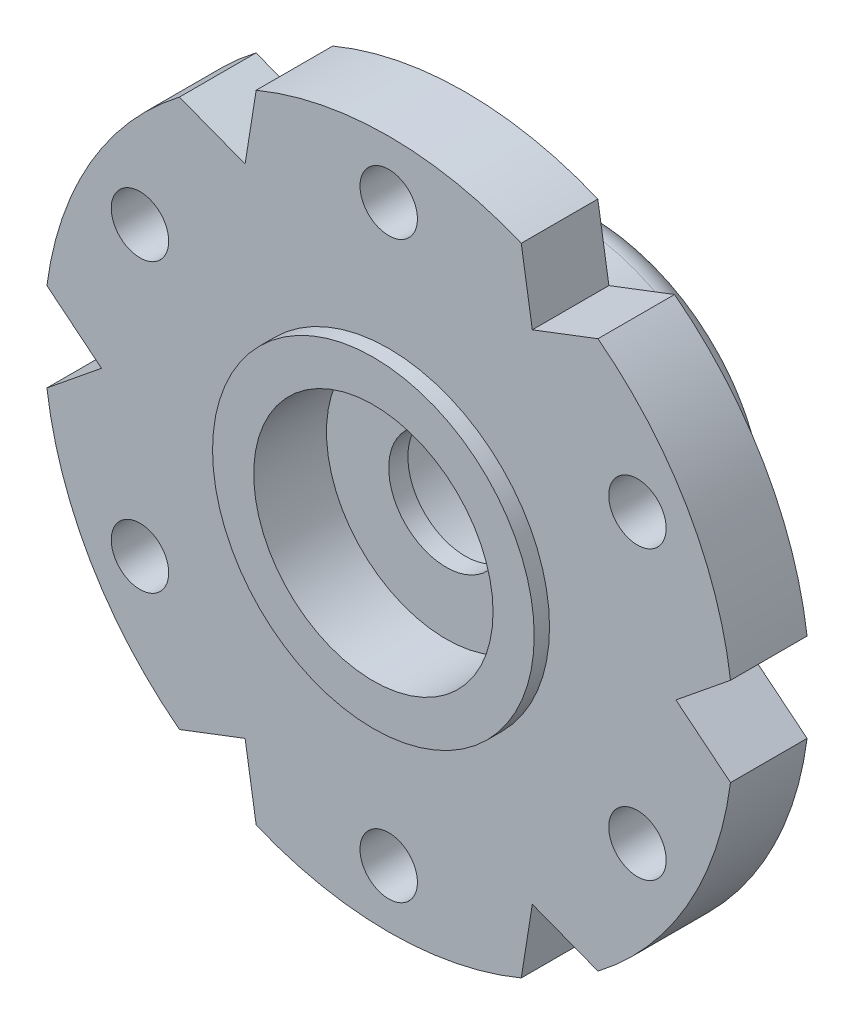
ISO-10303-21;
HEADER;
FILE_DESCRIPTION(('STEP AP214'),'2;1');
FILE_NAME('part.step','',(''),(''),'','','');
FILE_SCHEMA(('AUTOMOTIVE_DESIGN { 1 0 10303 214 1 1 1 1 }'));
ENDSEC;
DATA;
#1=APPLICATION_CONTEXT('core data for automotive mechanical design processes');
#2=APPLICATION_PROTOCOL_DEFINITION('international standard','automotive_design',2000,#1);
#3=PRODUCT_CONTEXT('',#1,'mechanical');
#4=PRODUCT('Part','Part','',(#3));
#5=PRODUCT_RELATED_PRODUCT_CATEGORY('part','',(#4));
#6=PRODUCT_DEFINITION_FORMATION('','',#4);
#7=PRODUCT_DEFINITION_CONTEXT('part definition',#1,'design');
#8=PRODUCT_DEFINITION('design','',#6,#7);
#9=PRODUCT_DEFINITION_SHAPE('','',#8);
#10=(LENGTH_UNIT() NAMED_UNIT(*) SI_UNIT(.MILLI.,.METRE.));
#11=(NAMED_UNIT(*) PLANE_ANGLE_UNIT() SI_UNIT($,.RADIAN.));
#12=(NAMED_UNIT(*) SI_UNIT($,.STERADIAN.) SOLID_ANGLE_UNIT());
#13=UNCERTAINTY_MEASURE_WITH_UNIT(LENGTH_MEASURE(1.E-05),#10,'distance_accuracy_value','');
#14=(GEOMETRIC_REPRESENTATION_CONTEXT(3) GLOBAL_UNCERTAINTY_ASSIGNED_CONTEXT((#13)) GLOBAL_UNIT_ASSIGNED_CONTEXT((#10,
#11,#12)) REPRESENTATION_CONTEXT('',''));
#15=CARTESIAN_POINT('',(0.,0.,0.));
#16=DIRECTION('',(0.,0.,1.));
#17=DIRECTION('',(1.,0.,0.));
#18=AXIS2_PLACEMENT_3D('',#15,#16,#17);
#19=CARTESIAN_POINT('',(0.,13.5,2.));
#20=DIRECTION('',(0.,0.,1.));
#21=DIRECTION('',(1.,0.,0.));
#22=AXIS2_PLACEMENT_3D('',#19,#20,#21);
#23=PLANE('',#22);
#24=CARTESIAN_POINT('',(0.,0.,2.));
#25=DIRECTION('',(0.,0.,1.));
#26=DIRECTION('',(1.,0.,0.));
#27=AXIS2_PLACEMENT_3D('',#24,#25,#26);
#28=CIRCLE('',#27,4.2);
#29=CARTESIAN_POINT('',(4.2,0.,2.));
#30=VERTEX_POINT('',#29);
#31=EDGE_CURVE('E383',#30,#30,#28,.T.);
#32=ORIENTED_EDGE('',*,*,#31,.F.);
#33=EDGE_LOOP('',(#32));
#34=FACE_BOUND('',#33,.T.);
#35=CARTESIAN_POINT('',(-6.49519052838329,3.75,2.));
#36=DIRECTION('',(0.,0.,1.));
#37=DIRECTION('',(1.,0.,0.));
#38=AXIS2_PLACEMENT_3D('',#35,#36,#37);
#39=CIRCLE('',#38,0.749999999999999);
#40=CARTESIAN_POINT('',(-5.74519052838329,3.75,2.));
#41=VERTEX_POINT('',#40);
#42=EDGE_CURVE('E377',#41,#41,#39,.T.);
#43=ORIENTED_EDGE('',*,*,#42,.F.);
#44=EDGE_LOOP('',(#43));
#45=FACE_BOUND('',#44,.T.);
#46=CARTESIAN_POINT('',(0.,-7.5,2.));
#47=DIRECTION('',(0.,0.,1.));
#48=DIRECTION('',(1.,0.,0.));
#49=AXIS2_PLACEMENT_3D('',#46,#47,#48);
#50=CIRCLE('',#49,0.75);
#51=CARTESIAN_POINT('',(0.75,-7.5,2.));
#52=VERTEX_POINT('',#51);
#53=EDGE_CURVE('E395',#52,#52,#50,.T.);
#54=ORIENTED_EDGE('',*,*,#53,.F.);
#55=EDGE_LOOP('',(#54));
#56=FACE_BOUND('',#55,.T.);
#57=CARTESIAN_POINT('',(6.49519052838329,3.75,2.));
#58=DIRECTION('',(0.,0.,1.));
#59=DIRECTION('',(1.,0.,0.));
#60=AXIS2_PLACEMENT_3D('',#57,#58,#59);
#61=CIRCLE('',#60,0.749999999999998);
#62=CARTESIAN_POINT('',(7.24519052838329,3.75,2.));
#63=VERTEX_POINT('',#62);
#64=EDGE_CURVE('E407',#63,#63,#61,.T.);
#65=ORIENTED_EDGE('',*,*,#64,.F.);
#66=EDGE_LOOP('',(#65));
#67=FACE_BOUND('',#66,.T.);
#68=CARTESIAN_POINT('',(0.,7.5,2.));
#69=DIRECTION('',(0.,0.,1.));
#70=DIRECTION('',(1.,0.,0.));
#71=AXIS2_PLACEMENT_3D('',#68,#69,#70);
#72=CIRCLE('',#71,0.75);
#73=CARTESIAN_POINT('',(0.75,7.5,2.));
#74=VERTEX_POINT('',#73);
#75=EDGE_CURVE('E413',#74,#74,#72,.T.);
#76=ORIENTED_EDGE('',*,*,#75,.F.);
#77=EDGE_LOOP('',(#76));
#78=FACE_BOUND('',#77,.T.);
#79=CARTESIAN_POINT('',(6.49519052838329,-3.75,2.));
#80=DIRECTION('',(0.,0.,1.));
#81=DIRECTION('',(1.,0.,0.));
#82=AXIS2_PLACEMENT_3D('',#79,#80,#81);
#83=CIRCLE('',#82,0.749999999999998);
#84=CARTESIAN_POINT('',(7.24519052838329,-3.75,2.));
#85=VERTEX_POINT('',#84);
#86=EDGE_CURVE('E401',#85,#85,#83,.T.);
#87=ORIENTED_EDGE('',*,*,#86,.F.);
#88=EDGE_LOOP('',(#87));
#89=FACE_BOUND('',#88,.T.);
#90=CARTESIAN_POINT('',(-6.49519052838329,-3.75,2.));
#91=DIRECTION('',(0.,0.,1.));
#92=DIRECTION('',(1.,0.,0.));
#93=AXIS2_PLACEMENT_3D('',#90,#91,#92);
#94=CIRCLE('',#93,0.749999999999999);
#95=CARTESIAN_POINT('',(-5.74519052838329,-3.75,2.));
#96=VERTEX_POINT('',#95);
#97=EDGE_CURVE('E389',#96,#96,#94,.T.);
#98=ORIENTED_EDGE('',*,*,#97,.F.);
#99=EDGE_LOOP('',(#98));
#100=FACE_BOUND('',#99,.T.);
#101=DIRECTION('',(0.776471673738177,0.630152156135511,0.));
#102=VECTOR('',#101,1.);
#103=CARTESIAN_POINT('',(13.3297385570423,4.73117364828074,2.));
#104=LINE('',#103,#102);
#105=CARTESIAN_POINT('',(7.5,0.,2.));
#106=VERTEX_POINT('',#105);
#107=CARTESIAN_POINT('',(8.92535231093644,1.15675672708725,2.));
#108=VERTEX_POINT('',#107);
#109=EDGE_CURVE('E189',#106,#108,#104,.T.);
#110=ORIENTED_EDGE('',*,*,#109,.T.);
#111=CARTESIAN_POINT('',(0.,0.,2.));
#112=DIRECTION('',(0.,0.,1.));
#113=DIRECTION('',(1.,0.,0.));
#114=AXIS2_PLACEMENT_3D('',#111,#112,#113);
#115=CIRCLE('',#114,9.);
#116=CARTESIAN_POINT('',(5.46445686712431,7.15120347545348,2.));
#117=VERTEX_POINT('',#116);
#118=EDGE_CURVE('E170',#108,#117,#115,.T.);
#119=ORIENTED_EDGE('',*,*,#118,.T.);
#120=DIRECTION('',(-0.933963612331979,-0.357368116708528,0.));
#121=VECTOR('',#120,1.);
#122=CARTESIAN_POINT('',(10.7621858476477,9.17830539206315,2.));
#123=LINE('',#122,#121);
#124=CARTESIAN_POINT('',(3.75,6.49519052838329,2.));
#125=VERTEX_POINT('',#124);
#126=EDGE_CURVE('E199',#117,#125,#123,.T.);
#127=ORIENTED_EDGE('',*,*,#126,.T.);
#128=DIRECTION('',(-0.157491938593802,0.987520272844039,0.));
#129=VECTOR('',#128,1.);
#130=CARTESIAN_POINT('',(2.56755270939451,13.9094790403439,2.));
#131=LINE('',#130,#129);
#132=CARTESIAN_POINT('',(3.46089544381212,8.30796020254073,2.));
#133=VERTEX_POINT('',#132);
#134=EDGE_CURVE('E201',#125,#133,#131,.T.);
#135=ORIENTED_EDGE('',*,*,#134,.T.);
#136=CARTESIAN_POINT('',(-3.46089544381212,8.30796020254072,2.));
#137=VERTEX_POINT('',#136);
#138=EDGE_CURVE('E181',#133,#137,#115,.T.);
#139=ORIENTED_EDGE('',*,*,#138,.T.);
#140=DIRECTION('',(-0.157491938593802,-0.987520272844039,0.));
#141=VECTOR('',#140,1.);
#142=CARTESIAN_POINT('',(-2.56755270939451,13.9094790403439,2.));
#143=LINE('',#142,#141);
#144=CARTESIAN_POINT('',(-3.75,6.49519052838329,2.));
#145=VERTEX_POINT('',#144);
#146=EDGE_CURVE('E239',#137,#145,#143,.T.);
#147=ORIENTED_EDGE('',*,*,#146,.T.);
#148=DIRECTION('',(-0.93396361233198,0.357368116708526,0.));
#149=VECTOR('',#148,1.);
#150=CARTESIAN_POINT('',(-10.7621858476478,9.17830539206314,2.));
#151=LINE('',#150,#149);
#152=CARTESIAN_POINT('',(-5.46445686712432,7.15120347545348,2.));
#153=VERTEX_POINT('',#152);
#154=EDGE_CURVE('E421',#145,#153,#151,.T.);
#155=ORIENTED_EDGE('',*,*,#154,.T.);
#156=CARTESIAN_POINT('',(-8.92535231093644,1.15675672708724,2.));
#157=VERTEX_POINT('',#156);
#158=EDGE_CURVE('E506',#153,#157,#115,.T.);
#159=ORIENTED_EDGE('',*,*,#158,.T.);
#160=DIRECTION('',(0.776471673738178,-0.63015215613551,0.));
#161=VECTOR('',#160,1.);
#162=CARTESIAN_POINT('',(-13.3297385570423,4.73117364828073,2.));
#163=LINE('',#162,#161);
#164=CARTESIAN_POINT('',(-7.5,0.,2.));
#165=VERTEX_POINT('',#164);
#166=EDGE_CURVE('E424',#157,#165,#163,.T.);
#167=ORIENTED_EDGE('',*,*,#166,.T.);
#168=DIRECTION('',(-0.776471673738177,-0.630152156135512,0.));
#169=VECTOR('',#168,1.);
#170=CARTESIAN_POINT('',(-13.3297385570423,-4.73117364828074,2.));
#171=LINE('',#170,#169);
#172=CARTESIAN_POINT('',(-8.92535231093644,-1.15675672708725,2.));
#173=VERTEX_POINT('',#172);
#174=EDGE_CURVE('E426',#165,#173,#171,.T.);
#175=ORIENTED_EDGE('',*,*,#174,.T.);
#176=CARTESIAN_POINT('',(-5.46445686712431,-7.15120347545348,2.));
#177=VERTEX_POINT('',#176);
#178=EDGE_CURVE('E513',#173,#177,#115,.T.);
#179=ORIENTED_EDGE('',*,*,#178,.T.);
#180=DIRECTION('',(0.933963612331979,0.357368116708529,0.));
#181=VECTOR('',#180,1.);
#182=CARTESIAN_POINT('',(-10.7621858476477,-9.17830539206316,2.));
#183=LINE('',#182,#181);
#184=CARTESIAN_POINT('',(-3.75,-6.49519052838329,2.));
#185=VERTEX_POINT('',#184);
#186=EDGE_CURVE('E429',#177,#185,#183,.T.);
#187=ORIENTED_EDGE('',*,*,#186,.T.);
#188=DIRECTION('',(0.157491938593802,-0.987520272844039,0.));
#189=VECTOR('',#188,1.);
#190=CARTESIAN_POINT('',(-2.56755270939451,-13.9094790403439,2.));
#191=LINE('',#190,#189);
#192=CARTESIAN_POINT('',(-3.46089544381212,-8.30796020254072,2.));
#193=VERTEX_POINT('',#192);
#194=EDGE_CURVE('E431',#185,#193,#191,.T.);
#195=ORIENTED_EDGE('',*,*,#194,.T.);
#196=CARTESIAN_POINT('',(3.46089544381212,-8.30796020254072,2.));
#197=VERTEX_POINT('',#196);
#198=EDGE_CURVE('E521',#193,#197,#115,.T.);
#199=ORIENTED_EDGE('',*,*,#198,.T.);
#200=DIRECTION('',(0.157491938593802,0.987520272844039,0.));
#201=VECTOR('',#200,1.);
#202=CARTESIAN_POINT('',(2.56755270939451,-13.9094790403439,2.));
#203=LINE('',#202,#201);
#204=CARTESIAN_POINT('',(3.75,-6.49519052838329,2.));
#205=VERTEX_POINT('',#204);
#206=EDGE_CURVE('E434',#197,#205,#203,.T.);
#207=ORIENTED_EDGE('',*,*,#206,.T.);
#208=DIRECTION('',(0.93396361233198,-0.357368116708528,0.));
#209=VECTOR('',#208,1.);
#210=CARTESIAN_POINT('',(10.7621858476478,-9.17830539206315,2.));
#211=LINE('',#210,#209);
#212=CARTESIAN_POINT('',(5.46445686712431,-7.15120347545348,2.));
#213=VERTEX_POINT('',#212);
#214=EDGE_CURVE('E203',#205,#213,#211,.T.);
#215=ORIENTED_EDGE('',*,*,#214,.T.);
#216=CARTESIAN_POINT('',(8.92535231093644,-1.15675672708724,2.));
#217=VERTEX_POINT('',#216);
#218=EDGE_CURVE('E183',#213,#217,#115,.T.);
#219=ORIENTED_EDGE('',*,*,#218,.T.);
#220=DIRECTION('',(-0.776471673738177,0.630152156135511,0.));
#221=VECTOR('',#220,1.);
#222=CARTESIAN_POINT('',(13.3297385570423,-4.73117364828073,2.));
#223=LINE('',#222,#221);
#224=EDGE_CURVE('E197',#217,#106,#223,.T.);
#225=ORIENTED_EDGE('',*,*,#224,.T.);
#226=EDGE_LOOP('',(#110,#119,#127,#135,#139,#147,#155,#159,#167,#175,#179,#187,#195,#199,#207,
#215,#219,#225));
#227=FACE_BOUND('',#226,.T.);
#228=ADVANCED_FACE('F47',(#34,#45,#56,#67,#78,#89,#100,#227),#23,.T.);
#229=CARTESIAN_POINT('',(0.,13.5,0.));
#230=DIRECTION('',(0.,0.,1.));
#231=DIRECTION('',(1.,0.,0.));
#232=AXIS2_PLACEMENT_3D('',#229,#230,#231);
#233=PLANE('',#232);
#234=CARTESIAN_POINT('',(0.,0.,0.));
#235=DIRECTION('',(0.,0.,1.));
#236=DIRECTION('',(1.,0.,0.));
#237=AXIS2_PLACEMENT_3D('',#234,#235,#236);
#238=CIRCLE('',#237,5.5);
#239=CARTESIAN_POINT('',(5.5,0.,0.));
#240=VERTEX_POINT('',#239);
#241=EDGE_CURVE('E55',#240,#240,#238,.T.);
#242=ORIENTED_EDGE('',*,*,#241,.T.);
#243=EDGE_LOOP('',(#242));
#244=FACE_BOUND('',#243,.T.);
#245=CARTESIAN_POINT('',(0.,7.5,0.));
#246=DIRECTION('',(0.,0.,1.));
#247=DIRECTION('',(1.,0.,0.));
#248=AXIS2_PLACEMENT_3D('',#245,#246,#247);
#249=CIRCLE('',#248,0.75);
#250=CARTESIAN_POINT('',(0.75,7.5,0.));
#251=VERTEX_POINT('',#250);
#252=EDGE_CURVE('E410',#251,#251,#249,.T.);
#253=ORIENTED_EDGE('',*,*,#252,.T.);
#254=EDGE_LOOP('',(#253));
#255=FACE_BOUND('',#254,.T.);
#256=CARTESIAN_POINT('',(6.49519052838329,3.75,0.));
#257=DIRECTION('',(0.,0.,1.));
#258=DIRECTION('',(1.,0.,0.));
#259=AXIS2_PLACEMENT_3D('',#256,#257,#258);
#260=CIRCLE('',#259,0.749999999999998);
#261=CARTESIAN_POINT('',(7.24519052838329,3.75,0.));
#262=VERTEX_POINT('',#261);
#263=EDGE_CURVE('E404',#262,#262,#260,.T.);
#264=ORIENTED_EDGE('',*,*,#263,.T.);
#265=EDGE_LOOP('',(#264));
#266=FACE_BOUND('',#265,.T.);
#267=CARTESIAN_POINT('',(6.49519052838329,-3.75,0.));
#268=DIRECTION('',(0.,0.,1.));
#269=DIRECTION('',(1.,0.,0.));
#270=AXIS2_PLACEMENT_3D('',#267,#268,#269);
#271=CIRCLE('',#270,0.749999999999998);
#272=CARTESIAN_POINT('',(7.24519052838329,-3.75,0.));
#273=VERTEX_POINT('',#272);
#274=EDGE_CURVE('E398',#273,#273,#271,.T.);
#275=ORIENTED_EDGE('',*,*,#274,.T.);
#276=EDGE_LOOP('',(#275));
#277=FACE_BOUND('',#276,.T.);
#278=CARTESIAN_POINT('',(0.,-7.5,0.));
#279=DIRECTION('',(0.,0.,1.));
#280=DIRECTION('',(1.,0.,0.));
#281=AXIS2_PLACEMENT_3D('',#278,#279,#280);
#282=CIRCLE('',#281,0.75);
#283=CARTESIAN_POINT('',(0.75,-7.5,0.));
#284=VERTEX_POINT('',#283);
#285=EDGE_CURVE('E392',#284,#284,#282,.T.);
#286=ORIENTED_EDGE('',*,*,#285,.T.);
#287=EDGE_LOOP('',(#286));
#288=FACE_BOUND('',#287,.T.);
#289=CARTESIAN_POINT('',(-6.49519052838329,-3.75,0.));
#290=DIRECTION('',(0.,0.,1.));
#291=DIRECTION('',(1.,0.,0.));
#292=AXIS2_PLACEMENT_3D('',#289,#290,#291);
#293=CIRCLE('',#292,0.749999999999999);
#294=CARTESIAN_POINT('',(-5.74519052838329,-3.75,0.));
#295=VERTEX_POINT('',#294);
#296=EDGE_CURVE('E387',#295,#295,#293,.T.);
#297=ORIENTED_EDGE('',*,*,#296,.T.);
#298=EDGE_LOOP('',(#297));
#299=FACE_BOUND('',#298,.T.);
#300=CARTESIAN_POINT('',(-6.49519052838329,3.75,0.));
#301=DIRECTION('',(0.,0.,1.));
#302=DIRECTION('',(1.,0.,0.));
#303=AXIS2_PLACEMENT_3D('',#300,#301,#302);
#304=CIRCLE('',#303,0.749999999999999);
#305=CARTESIAN_POINT('',(-5.74519052838329,3.75,0.));
#306=VERTEX_POINT('',#305);
#307=EDGE_CURVE('E373',#306,#306,#304,.T.);
#308=ORIENTED_EDGE('',*,*,#307,.T.);
#309=EDGE_LOOP('',(#308));
#310=FACE_BOUND('',#309,.T.);
#311=CARTESIAN_POINT('',(0.,0.,0.));
#312=DIRECTION('',(0.,0.,1.));
#313=DIRECTION('',(1.,0.,0.));
#314=AXIS2_PLACEMENT_3D('',#311,#312,#313);
#315=CIRCLE('',#314,9.);
#316=CARTESIAN_POINT('',(8.92535231093644,1.15675672708725,0.));
#317=VERTEX_POINT('',#316);
#318=CARTESIAN_POINT('',(5.46445686712431,7.15120347545348,0.));
#319=VERTEX_POINT('',#318);
#320=EDGE_CURVE('E193',#317,#319,#315,.T.);
#321=ORIENTED_EDGE('',*,*,#320,.F.);
#322=DIRECTION('',(0.776471673738177,0.630152156135511,0.));
#323=VECTOR('',#322,1.);
#324=CARTESIAN_POINT('',(13.3297385570423,4.73117364828074,0.));
#325=LINE('',#324,#323);
#326=CARTESIAN_POINT('',(7.5,0.,0.));
#327=VERTEX_POINT('',#326);
#328=EDGE_CURVE('E191',#327,#317,#325,.T.);
#329=ORIENTED_EDGE('',*,*,#328,.F.);
#330=DIRECTION('',(-0.776471673738177,0.630152156135511,0.));
#331=VECTOR('',#330,1.);
#332=CARTESIAN_POINT('',(13.3297385570423,-4.73117364828073,0.));
#333=LINE('',#332,#331);
#334=CARTESIAN_POINT('',(8.92535231093644,-1.15675672708724,0.));
#335=VERTEX_POINT('',#334);
#336=EDGE_CURVE('E231',#335,#327,#333,.T.);
#337=ORIENTED_EDGE('',*,*,#336,.F.);
#338=CARTESIAN_POINT('',(5.46445686712431,-7.15120347545348,0.));
#339=VERTEX_POINT('',#338);
#340=EDGE_CURVE('E446',#339,#335,#315,.T.);
#341=ORIENTED_EDGE('',*,*,#340,.F.);
#342=DIRECTION('',(0.93396361233198,-0.357368116708528,0.));
#343=VECTOR('',#342,1.);
#344=CARTESIAN_POINT('',(10.7621858476478,-9.17830539206315,0.));
#345=LINE('',#344,#343);
#346=CARTESIAN_POINT('',(3.75,-6.49519052838329,0.));
#347=VERTEX_POINT('',#346);
#348=EDGE_CURVE('E228',#347,#339,#345,.T.);
#349=ORIENTED_EDGE('',*,*,#348,.F.);
#350=DIRECTION('',(0.157491938593802,0.987520272844039,0.));
#351=VECTOR('',#350,1.);
#352=CARTESIAN_POINT('',(2.56755270939451,-13.9094790403439,0.));
#353=LINE('',#352,#351);
#354=CARTESIAN_POINT('',(3.46089544381212,-8.30796020254072,0.));
#355=VERTEX_POINT('',#354);
#356=EDGE_CURVE('E226',#355,#347,#353,.T.);
#357=ORIENTED_EDGE('',*,*,#356,.F.);
#358=CARTESIAN_POINT('',(-3.46089544381212,-8.30796020254072,0.));
#359=VERTEX_POINT('',#358);
#360=EDGE_CURVE('E448',#359,#355,#315,.T.);
#361=ORIENTED_EDGE('',*,*,#360,.F.);
#362=DIRECTION('',(0.157491938593802,-0.987520272844039,0.));
#363=VECTOR('',#362,1.);
#364=CARTESIAN_POINT('',(-2.56755270939451,-13.9094790403439,0.));
#365=LINE('',#364,#363);
#366=CARTESIAN_POINT('',(-3.75,-6.49519052838329,0.));
#367=VERTEX_POINT('',#366);
#368=EDGE_CURVE('E223',#367,#359,#365,.T.);
#369=ORIENTED_EDGE('',*,*,#368,.F.);
#370=DIRECTION('',(0.933963612331979,0.357368116708529,0.));
#371=VECTOR('',#370,1.);
#372=CARTESIAN_POINT('',(-10.7621858476477,-9.17830539206316,0.));
#373=LINE('',#372,#371);
#374=CARTESIAN_POINT('',(-5.46445686712431,-7.15120347545348,0.));
#375=VERTEX_POINT('',#374);
#376=EDGE_CURVE('E221',#375,#367,#373,.T.);
#377=ORIENTED_EDGE('',*,*,#376,.F.);
#378=CARTESIAN_POINT('',(-8.92535231093644,-1.15675672708725,0.));
#379=VERTEX_POINT('',#378);
#380=EDGE_CURVE('E70',#379,#375,#315,.T.);
#381=ORIENTED_EDGE('',*,*,#380,.F.);
#382=DIRECTION('',(-0.776471673738177,-0.630152156135512,0.));
#383=VECTOR('',#382,1.);
#384=CARTESIAN_POINT('',(-13.3297385570423,-4.73117364828074,0.));
#385=LINE('',#384,#383);
#386=CARTESIAN_POINT('',(-7.5,0.,0.));
#387=VERTEX_POINT('',#386);
#388=EDGE_CURVE('E218',#387,#379,#385,.T.);
#389=ORIENTED_EDGE('',*,*,#388,.F.);
#390=DIRECTION('',(0.776471673738178,-0.63015215613551,0.));
#391=VECTOR('',#390,1.);
#392=CARTESIAN_POINT('',(-13.3297385570423,4.73117364828073,0.));
#393=LINE('',#392,#391);
#394=CARTESIAN_POINT('',(-8.92535231093644,1.15675672708724,0.));
#395=VERTEX_POINT('',#394);
#396=EDGE_CURVE('E216',#395,#387,#393,.T.);
#397=ORIENTED_EDGE('',*,*,#396,.F.);
#398=CARTESIAN_POINT('',(-5.46445686712432,7.15120347545348,0.));
#399=VERTEX_POINT('',#398);
#400=EDGE_CURVE('E62',#399,#395,#315,.T.);
#401=ORIENTED_EDGE('',*,*,#400,.F.);
#402=DIRECTION('',(-0.93396361233198,0.357368116708526,0.));
#403=VECTOR('',#402,1.);
#404=CARTESIAN_POINT('',(-10.7621858476478,9.17830539206314,0.));
#405=LINE('',#404,#403);
#406=CARTESIAN_POINT('',(-3.75,6.49519052838329,0.));
#407=VERTEX_POINT('',#406);
#408=EDGE_CURVE('E212',#407,#399,#405,.T.);
#409=ORIENTED_EDGE('',*,*,#408,.F.);
#410=DIRECTION('',(-0.157491938593802,-0.987520272844039,0.));
#411=VECTOR('',#410,1.);
#412=CARTESIAN_POINT('',(-2.56755270939451,13.9094790403439,0.));
#413=LINE('',#412,#411);
#414=CARTESIAN_POINT('',(-3.46089544381212,8.30796020254072,0.));
#415=VERTEX_POINT('',#414);
#416=EDGE_CURVE('E210',#415,#407,#413,.T.);
#417=ORIENTED_EDGE('',*,*,#416,.F.);
#418=CARTESIAN_POINT('',(3.46089544381212,8.30796020254072,0.));
#419=VERTEX_POINT('',#418);
#420=EDGE_CURVE('E180',#419,#415,#315,.T.);
#421=ORIENTED_EDGE('',*,*,#420,.F.);
#422=DIRECTION('',(-0.157491938593802,0.987520272844039,0.));
#423=VECTOR('',#422,1.);
#424=CARTESIAN_POINT('',(2.56755270939451,13.9094790403439,0.));
#425=LINE('',#424,#423);
#426=CARTESIAN_POINT('',(3.75,6.49519052838329,0.));
#427=VERTEX_POINT('',#426);
#428=EDGE_CURVE('E236',#427,#419,#425,.T.);
#429=ORIENTED_EDGE('',*,*,#428,.F.);
#430=DIRECTION('',(-0.933963612331979,-0.357368116708528,0.));
#431=VECTOR('',#430,1.);
#432=CARTESIAN_POINT('',(10.7621858476477,9.17830539206315,0.));
#433=LINE('',#432,#431);
#434=EDGE_CURVE('E234',#319,#427,#433,.T.);
#435=ORIENTED_EDGE('',*,*,#434,.F.);
#436=EDGE_LOOP('',(#321,#329,#337,#341,#349,#357,#361,#369,#377,#381,#389,#397,#401,#409,#417,
#421,#429,#435));
#437=FACE_BOUND('',#436,.T.);
#438=ADVANCED_FACE('F272',(#244,#255,#266,#277,#288,#299,#310,#437),#233,.F.);
#439=CARTESIAN_POINT('',(-2.56755270939451,13.9094790403439,2.));
#440=DIRECTION('',(0.987520272844039,-0.157491938593802,0.));
#441=DIRECTION('',(0.157491938593802,0.987520272844039,0.));
#442=AXIS2_PLACEMENT_3D('',#439,#440,#441);
#443=PLANE('',#442);
#444=DIRECTION('',(0.,0.,1.));
#445=VECTOR('',#444,1.);
#446=CARTESIAN_POINT('',(-3.46089544381212,8.30796020254072,-3.5));
#447=LINE('',#446,#445);
#448=EDGE_CURVE('E497',#415,#137,#447,.T.);
#449=ORIENTED_EDGE('',*,*,#448,.F.);
#450=ORIENTED_EDGE('',*,*,#416,.T.);
#451=DIRECTION('',(0.,0.,-1.));
#452=VECTOR('',#451,1.);
#453=CARTESIAN_POINT('',(-3.75,6.49519052838329,2.));
#454=LINE('',#453,#452);
#455=EDGE_CURVE('E253',#145,#407,#454,.T.);
#456=ORIENTED_EDGE('',*,*,#455,.F.);
#457=ORIENTED_EDGE('',*,*,#146,.F.);
#458=EDGE_LOOP('',(#449,#450,#456,#457));
#459=FACE_BOUND('',#458,.T.);
#460=ADVANCED_FACE('F304',(#459),#443,.F.);
#461=CARTESIAN_POINT('',(-10.7621858476478,9.17830539206314,2.));
#462=DIRECTION('',(-0.357368116708526,-0.93396361233198,0.));
#463=DIRECTION('',(0.93396361233198,-0.357368116708526,0.));
#464=AXIS2_PLACEMENT_3D('',#461,#462,#463);
#465=PLANE('',#464);
#466=DIRECTION('',(0.,0.,1.));
#467=VECTOR('',#466,1.);
#468=CARTESIAN_POINT('',(-5.46445686712432,7.15120347545348,-3.5));
#469=LINE('',#468,#467);
#470=EDGE_CURVE('E461',#153,#399,#469,.F.);
#471=ORIENTED_EDGE('',*,*,#470,.F.);
#472=ORIENTED_EDGE('',*,*,#154,.F.);
#473=ORIENTED_EDGE('',*,*,#455,.T.);
#474=ORIENTED_EDGE('',*,*,#408,.T.);
#475=EDGE_LOOP('',(#471,#472,#473,#474));
#476=FACE_BOUND('',#475,.T.);
#477=ADVANCED_FACE('F350',(#476),#465,.F.);
#478=CARTESIAN_POINT('',(-13.3297385570423,4.73117364828073,2.));
#479=DIRECTION('',(0.63015215613551,0.776471673738178,0.));
#480=DIRECTION('',(-0.776471673738178,0.630152156135511,0.));
#481=AXIS2_PLACEMENT_3D('',#478,#479,#480);
#482=PLANE('',#481);
#483=DIRECTION('',(0.,0.,1.));
#484=VECTOR('',#483,1.);
#485=CARTESIAN_POINT('',(-8.92535231093644,1.15675672708724,-3.5));
#486=LINE('',#485,#484);
#487=EDGE_CURVE('E459',#395,#157,#486,.T.);
#488=ORIENTED_EDGE('',*,*,#487,.F.);
#489=ORIENTED_EDGE('',*,*,#396,.T.);
#490=DIRECTION('',(0.,0.,-1.));
#491=VECTOR('',#490,1.);
#492=CARTESIAN_POINT('',(-7.5,0.,2.));
#493=LINE('',#492,#491);
#494=EDGE_CURVE('E250',#165,#387,#493,.T.);
#495=ORIENTED_EDGE('',*,*,#494,.F.);
#496=ORIENTED_EDGE('',*,*,#166,.F.);
#497=EDGE_LOOP('',(#488,#489,#495,#496));
#498=FACE_BOUND('',#497,.T.);
#499=ADVANCED_FACE('F346',(#498),#482,.F.);
#500=CARTESIAN_POINT('',(-13.3297385570423,-4.73117364828074,2.));
#501=DIRECTION('',(0.630152156135512,-0.776471673738177,0.));
#502=DIRECTION('',(0.776471673738177,0.630152156135512,0.));
#503=AXIS2_PLACEMENT_3D('',#500,#501,#502);
#504=PLANE('',#503);
#505=DIRECTION('',(0.,0.,1.));
#506=VECTOR('',#505,1.);
#507=CARTESIAN_POINT('',(-8.92535231093644,-1.15675672708725,-3.5));
#508=LINE('',#507,#506);
#509=EDGE_CURVE('E457',#173,#379,#508,.F.);
#510=ORIENTED_EDGE('',*,*,#509,.F.);
#511=ORIENTED_EDGE('',*,*,#174,.F.);
#512=ORIENTED_EDGE('',*,*,#494,.T.);
#513=ORIENTED_EDGE('',*,*,#388,.T.);
#514=EDGE_LOOP('',(#510,#511,#512,#513));
#515=FACE_BOUND('',#514,.T.);
#516=ADVANCED_FACE('F342',(#515),#504,.F.);
#517=CARTESIAN_POINT('',(-10.7621858476477,-9.17830539206316,2.));
#518=DIRECTION('',(-0.357368116708529,0.933963612331979,0.));
#519=DIRECTION('',(-0.933963612331979,-0.357368116708529,0.));
#520=AXIS2_PLACEMENT_3D('',#517,#518,#519);
#521=PLANE('',#520);
#522=DIRECTION('',(0.,0.,1.));
#523=VECTOR('',#522,1.);
#524=CARTESIAN_POINT('',(-5.46445686712431,-7.15120347545348,-3.5));
#525=LINE('',#524,#523);
#526=EDGE_CURVE('E455',#375,#177,#525,.T.);
#527=ORIENTED_EDGE('',*,*,#526,.F.);
#528=ORIENTED_EDGE('',*,*,#376,.T.);
#529=DIRECTION('',(0.,0.,-1.));
#530=VECTOR('',#529,1.);
#531=CARTESIAN_POINT('',(-3.75,-6.49519052838329,2.));
#532=LINE('',#531,#530);
#533=EDGE_CURVE('E247',#185,#367,#532,.T.);
#534=ORIENTED_EDGE('',*,*,#533,.F.);
#535=ORIENTED_EDGE('',*,*,#186,.F.);
#536=EDGE_LOOP('',(#527,#528,#534,#535));
#537=FACE_BOUND('',#536,.T.);
#538=ADVANCED_FACE('F338',(#537),#521,.F.);
#539=CARTESIAN_POINT('',(-2.56755270939451,-13.9094790403439,2.));
#540=DIRECTION('',(0.987520272844039,0.157491938593802,0.));
#541=DIRECTION('',(-0.157491938593802,0.987520272844039,0.));
#542=AXIS2_PLACEMENT_3D('',#539,#540,#541);
#543=PLANE('',#542);
#544=DIRECTION('',(0.,0.,1.));
#545=VECTOR('',#544,1.);
#546=CARTESIAN_POINT('',(-3.46089544381212,-8.30796020254072,-3.5));
#547=LINE('',#546,#545);
#548=EDGE_CURVE('E453',#193,#359,#547,.F.);
#549=ORIENTED_EDGE('',*,*,#548,.F.);
#550=ORIENTED_EDGE('',*,*,#194,.F.);
#551=ORIENTED_EDGE('',*,*,#533,.T.);
#552=ORIENTED_EDGE('',*,*,#368,.T.);
#553=EDGE_LOOP('',(#549,#550,#551,#552));
#554=FACE_BOUND('',#553,.T.);
#555=ADVANCED_FACE('F334',(#554),#543,.F.);
#556=CARTESIAN_POINT('',(2.56755270939451,-13.9094790403439,2.));
#557=DIRECTION('',(-0.987520272844039,0.157491938593802,0.));
#558=DIRECTION('',(-0.157491938593802,-0.98752027284404,0.));
#559=AXIS2_PLACEMENT_3D('',#556,#557,#558);
#560=PLANE('',#559);
#561=DIRECTION('',(0.,0.,1.));
#562=VECTOR('',#561,1.);
#563=CARTESIAN_POINT('',(3.46089544381212,-8.30796020254072,-3.5));
#564=LINE('',#563,#562);
#565=EDGE_CURVE('E445',#355,#197,#564,.T.);
#566=ORIENTED_EDGE('',*,*,#565,.F.);
#567=ORIENTED_EDGE('',*,*,#356,.T.);
#568=DIRECTION('',(0.,0.,-1.));
#569=VECTOR('',#568,1.);
#570=CARTESIAN_POINT('',(3.75,-6.49519052838329,2.));
#571=LINE('',#570,#569);
#572=EDGE_CURVE('E244',#205,#347,#571,.T.);
#573=ORIENTED_EDGE('',*,*,#572,.F.);
#574=ORIENTED_EDGE('',*,*,#206,.F.);
#575=EDGE_LOOP('',(#566,#567,#573,#574));
#576=FACE_BOUND('',#575,.T.);
#577=ADVANCED_FACE('F330',(#576),#560,.F.);
#578=CARTESIAN_POINT('',(10.7621858476478,-9.17830539206315,2.));
#579=DIRECTION('',(0.357368116708528,0.93396361233198,0.));
#580=DIRECTION('',(-0.93396361233198,0.357368116708528,0.));
#581=AXIS2_PLACEMENT_3D('',#578,#579,#580);
#582=PLANE('',#581);
#583=DIRECTION('',(0.,0.,1.));
#584=VECTOR('',#583,1.);
#585=CARTESIAN_POINT('',(5.46445686712431,-7.15120347545348,-3.5));
#586=LINE('',#585,#584);
#587=EDGE_CURVE('E442',#213,#339,#586,.F.);
#588=ORIENTED_EDGE('',*,*,#587,.F.);
#589=ORIENTED_EDGE('',*,*,#214,.F.);
#590=ORIENTED_EDGE('',*,*,#572,.T.);
#591=ORIENTED_EDGE('',*,*,#348,.T.);
#592=EDGE_LOOP('',(#588,#589,#590,#591));
#593=FACE_BOUND('',#592,.T.);
#594=ADVANCED_FACE('F326',(#593),#582,.F.);
#595=CARTESIAN_POINT('',(13.3297385570423,-4.73117364828073,2.));
#596=DIRECTION('',(-0.630152156135511,-0.776471673738177,0.));
#597=DIRECTION('',(0.776471673738177,-0.630152156135511,0.));
#598=AXIS2_PLACEMENT_3D('',#595,#596,#597);
#599=PLANE('',#598);
#600=DIRECTION('',(0.,0.,1.));
#601=VECTOR('',#600,1.);
#602=CARTESIAN_POINT('',(8.92535231093644,-1.15675672708724,-3.5));
#603=LINE('',#602,#601);
#604=EDGE_CURVE('E192',#335,#217,#603,.T.);
#605=ORIENTED_EDGE('',*,*,#604,.F.);
#606=ORIENTED_EDGE('',*,*,#336,.T.);
#607=DIRECTION('',(0.,0.,-1.));
#608=VECTOR('',#607,1.);
#609=CARTESIAN_POINT('',(7.5,0.,2.));
#610=LINE('',#609,#608);
#611=EDGE_CURVE('E242',#106,#327,#610,.T.);
#612=ORIENTED_EDGE('',*,*,#611,.F.);
#613=ORIENTED_EDGE('',*,*,#224,.F.);
#614=EDGE_LOOP('',(#605,#606,#612,#613));
#615=FACE_BOUND('',#614,.T.);
#616=ADVANCED_FACE('F323',(#615),#599,.F.);
#617=CARTESIAN_POINT('',(13.3297385570423,4.73117364828074,2.));
#618=DIRECTION('',(-0.630152156135511,0.776471673738177,0.));
#619=DIRECTION('',(-0.776471673738177,-0.630152156135511,0.));
#620=AXIS2_PLACEMENT_3D('',#617,#618,#619);
#621=PLANE('',#620);
#622=DIRECTION('',(0.,0.,1.));
#623=VECTOR('',#622,1.);
#624=CARTESIAN_POINT('',(8.92535231093644,1.15675672708725,-3.5));
#625=LINE('',#624,#623);
#626=EDGE_CURVE('E173',#108,#317,#625,.F.);
#627=ORIENTED_EDGE('',*,*,#626,.F.);
#628=ORIENTED_EDGE('',*,*,#109,.F.);
#629=ORIENTED_EDGE('',*,*,#611,.T.);
#630=ORIENTED_EDGE('',*,*,#328,.T.);
#631=EDGE_LOOP('',(#627,#628,#629,#630));
#632=FACE_BOUND('',#631,.T.);
#633=ADVANCED_FACE('F187',(#632),#621,.F.);
#634=CARTESIAN_POINT('',(10.7621858476477,9.17830539206315,2.));
#635=DIRECTION('',(0.357368116708528,-0.933963612331979,0.));
#636=DIRECTION('',(0.933963612331979,0.357368116708528,0.));
#637=AXIS2_PLACEMENT_3D('',#634,#635,#636);
#638=PLANE('',#637);
#639=DIRECTION('',(0.,0.,1.));
#640=VECTOR('',#639,1.);
#641=CARTESIAN_POINT('',(5.46445686712431,7.15120347545348,-3.5));
#642=LINE('',#641,#640);
#643=EDGE_CURVE('E176',#319,#117,#642,.T.);
#644=ORIENTED_EDGE('',*,*,#643,.F.);
#645=ORIENTED_EDGE('',*,*,#434,.T.);
#646=DIRECTION('',(0.,0.,-1.));
#647=VECTOR('',#646,1.);
#648=CARTESIAN_POINT('',(3.75,6.49519052838329,2.));
#649=LINE('',#648,#647);
#650=EDGE_CURVE('E209',#125,#427,#649,.T.);
#651=ORIENTED_EDGE('',*,*,#650,.F.);
#652=ORIENTED_EDGE('',*,*,#126,.F.);
#653=EDGE_LOOP('',(#644,#645,#651,#652));
#654=FACE_BOUND('',#653,.T.);
#655=ADVANCED_FACE('F316',(#654),#638,.F.);
#656=CARTESIAN_POINT('',(2.56755270939451,13.9094790403439,2.));
#657=DIRECTION('',(-0.987520272844039,-0.157491938593802,0.));
#658=DIRECTION('',(0.157491938593802,-0.987520272844039,0.));
#659=AXIS2_PLACEMENT_3D('',#656,#657,#658);
#660=PLANE('',#659);
#661=DIRECTION('',(0.,0.,1.));
#662=VECTOR('',#661,1.);
#663=CARTESIAN_POINT('',(3.46089544381212,8.30796020254072,-3.5));
#664=LINE('',#663,#662);
#665=EDGE_CURVE('E14',#133,#419,#664,.F.);
#666=ORIENTED_EDGE('',*,*,#665,.F.);
#667=ORIENTED_EDGE('',*,*,#134,.F.);
#668=ORIENTED_EDGE('',*,*,#650,.T.);
#669=ORIENTED_EDGE('',*,*,#428,.T.);
#670=EDGE_LOOP('',(#666,#667,#668,#669));
#671=FACE_BOUND('',#670,.T.);
#672=ADVANCED_FACE('F313',(#671),#660,.F.);
#673=CARTESIAN_POINT('',(0.,0.,2.));
#674=DIRECTION('',(0.,0.,-1.));
#675=DIRECTION('',(-1.,0.,0.));
#676=AXIS2_PLACEMENT_3D('',#673,#674,#675);
#677=CYLINDRICAL_SURFACE('',#676,1.5);
#678=CARTESIAN_POINT('',(0.,0.,0.));
#679=DIRECTION('',(0.,0.,1.));
#680=DIRECTION('',(1.,0.,0.));
#681=AXIS2_PLACEMENT_3D('',#678,#679,#680);
#682=CIRCLE('',#681,1.5);
#683=CARTESIAN_POINT('',(1.5,0.,0.));
#684=VERTEX_POINT('',#683);
#685=EDGE_CURVE('E213',#684,#684,#682,.T.);
#686=ORIENTED_EDGE('',*,*,#685,.F.);
#687=EDGE_LOOP('',(#686));
#688=FACE_BOUND('',#687,.T.);
#689=CARTESIAN_POINT('',(0.,0.,0.5));
#690=DIRECTION('',(0.,0.,1.));
#691=DIRECTION('',(1.,0.,0.));
#692=AXIS2_PLACEMENT_3D('',#689,#690,#691);
#693=CIRCLE('',#692,1.5);
#694=CARTESIAN_POINT('',(1.5,0.,0.5));
#695=VERTEX_POINT('',#694);
#696=EDGE_CURVE('E257',#695,#695,#693,.T.);
#697=ORIENTED_EDGE('',*,*,#696,.T.);
#698=EDGE_LOOP('',(#697));
#699=FACE_BOUND('',#698,.T.);
#700=ADVANCED_FACE('F310',(#688,#699),#677,.F.);
#701=ORIENTED_EDGE('',*,*,#685,.T.);
#702=EDGE_LOOP('',(#701));
#703=FACE_BOUND('',#702,.T.);
#704=CARTESIAN_POINT('',(0.,0.,0.));
#705=DIRECTION('',(0.,0.,-1.));
#706=DIRECTION('',(-1.,0.,0.));
#707=AXIS2_PLACEMENT_3D('',#704,#705,#706);
#708=CIRCLE('',#707,2.7);
#709=CARTESIAN_POINT('',(-2.7,0.,0.));
#710=VERTEX_POINT('',#709);
#711=EDGE_CURVE('E374',#710,#710,#708,.T.);
#712=ORIENTED_EDGE('',*,*,#711,.T.);
#713=EDGE_LOOP('',(#712));
#714=FACE_BOUND('',#713,.T.);
#715=ADVANCED_FACE('F306',(#703,#714),#233,.F.);
#716=CARTESIAN_POINT('',(0.,7.5,2.));
#717=DIRECTION('',(0.,0.,-1.));
#718=DIRECTION('',(-1.,0.,0.));
#719=AXIS2_PLACEMENT_3D('',#716,#717,#718);
#720=CYLINDRICAL_SURFACE('',#719,0.75);
#721=ORIENTED_EDGE('',*,*,#75,.T.);
#722=EDGE_LOOP('',(#721));
#723=FACE_BOUND('',#722,.T.);
#724=ORIENTED_EDGE('',*,*,#252,.F.);
#725=EDGE_LOOP('',(#724));
#726=FACE_BOUND('',#725,.T.);
#727=ADVANCED_FACE('F699',(#723,#726),#720,.F.);
#728=CARTESIAN_POINT('',(6.49519052838329,3.75,2.));
#729=DIRECTION('',(0.,0.,-1.));
#730=DIRECTION('',(-1.,0.,0.));
#731=AXIS2_PLACEMENT_3D('',#728,#729,#730);
#732=CYLINDRICAL_SURFACE('',#731,0.749999999999998);
#733=ORIENTED_EDGE('',*,*,#64,.T.);
#734=EDGE_LOOP('',(#733));
#735=FACE_BOUND('',#734,.T.);
#736=ORIENTED_EDGE('',*,*,#263,.F.);
#737=EDGE_LOOP('',(#736));
#738=FACE_BOUND('',#737,.T.);
#739=ADVANCED_FACE('F737',(#735,#738),#732,.F.);
#740=CARTESIAN_POINT('',(6.49519052838329,-3.75,2.));
#741=DIRECTION('',(0.,0.,-1.));
#742=DIRECTION('',(-1.,0.,0.));
#743=AXIS2_PLACEMENT_3D('',#740,#741,#742);
#744=CYLINDRICAL_SURFACE('',#743,0.749999999999998);
#745=ORIENTED_EDGE('',*,*,#86,.T.);
#746=EDGE_LOOP('',(#745));
#747=FACE_BOUND('',#746,.T.);
#748=ORIENTED_EDGE('',*,*,#274,.F.);
#749=EDGE_LOOP('',(#748));
#750=FACE_BOUND('',#749,.T.);
#751=ADVANCED_FACE('F727',(#747,#750),#744,.F.);
#752=CARTESIAN_POINT('',(0.,-7.5,2.));
#753=DIRECTION('',(0.,0.,-1.));
#754=DIRECTION('',(-1.,0.,0.));
#755=AXIS2_PLACEMENT_3D('',#752,#753,#754);
#756=CYLINDRICAL_SURFACE('',#755,0.75);
#757=ORIENTED_EDGE('',*,*,#53,.T.);
#758=EDGE_LOOP('',(#757));
#759=FACE_BOUND('',#758,.T.);
#760=ORIENTED_EDGE('',*,*,#285,.F.);
#761=EDGE_LOOP('',(#760));
#762=FACE_BOUND('',#761,.T.);
#763=ADVANCED_FACE('F717',(#759,#762),#756,.F.);
#764=CARTESIAN_POINT('',(-6.49519052838329,-3.75,2.));
#765=DIRECTION('',(0.,0.,-1.));
#766=DIRECTION('',(-1.,0.,0.));
#767=AXIS2_PLACEMENT_3D('',#764,#765,#766);
#768=CYLINDRICAL_SURFACE('',#767,0.749999999999999);
#769=ORIENTED_EDGE('',*,*,#97,.T.);
#770=EDGE_LOOP('',(#769));
#771=FACE_BOUND('',#770,.T.);
#772=ORIENTED_EDGE('',*,*,#296,.F.);
#773=EDGE_LOOP('',(#772));
#774=FACE_BOUND('',#773,.T.);
#775=ADVANCED_FACE('F708',(#771,#774),#768,.F.);
#776=CARTESIAN_POINT('',(-6.49519052838329,3.75,2.));
#777=DIRECTION('',(0.,0.,-1.));
#778=DIRECTION('',(-1.,0.,0.));
#779=AXIS2_PLACEMENT_3D('',#776,#777,#778);
#780=CYLINDRICAL_SURFACE('',#779,0.749999999999999);
#781=ORIENTED_EDGE('',*,*,#42,.T.);
#782=EDGE_LOOP('',(#781));
#783=FACE_BOUND('',#782,.T.);
#784=ORIENTED_EDGE('',*,*,#307,.F.);
#785=EDGE_LOOP('',(#784));
#786=FACE_BOUND('',#785,.T.);
#787=ADVANCED_FACE('F294',(#783,#786),#780,.F.);
#788=CARTESIAN_POINT('',(0.,0.,-3.5));
#789=DIRECTION('',(0.,0.,-1.));
#790=DIRECTION('',(-1.,0.,0.));
#791=AXIS2_PLACEMENT_3D('',#788,#789,#790);
#792=PLANE('',#791);
#793=CARTESIAN_POINT('',(0.,0.,-3.5));
#794=DIRECTION('',(0.,0.,-1.));
#795=DIRECTION('',(-1.,0.,0.));
#796=AXIS2_PLACEMENT_3D('',#793,#794,#795);
#797=CIRCLE('',#796,4.);
#798=CARTESIAN_POINT('',(-4.,0.,-3.5));
#799=VERTEX_POINT('',#798);
#800=EDGE_CURVE('E256',#799,#799,#797,.T.);
#801=ORIENTED_EDGE('',*,*,#800,.T.);
#802=EDGE_LOOP('',(#801));
#803=FACE_BOUND('',#802,.T.);
#804=CARTESIAN_POINT('',(0.,0.,-3.5));
#805=DIRECTION('',(0.,0.,-1.));
#806=DIRECTION('',(-1.,0.,0.));
#807=AXIS2_PLACEMENT_3D('',#804,#805,#806);
#808=CIRCLE('',#807,2.7);
#809=CARTESIAN_POINT('',(-2.7,0.,-3.5));
#810=VERTEX_POINT('',#809);
#811=EDGE_CURVE('E372',#810,#810,#808,.T.);
#812=ORIENTED_EDGE('',*,*,#811,.F.);
#813=EDGE_LOOP('',(#812));
#814=FACE_BOUND('',#813,.T.);
#815=ADVANCED_FACE('F284',(#803,#814),#792,.T.);
#816=CARTESIAN_POINT('',(0.,0.,-3.5));
#817=DIRECTION('',(0.,0.,1.));
#818=DIRECTION('',(1.,0.,0.));
#819=AXIS2_PLACEMENT_3D('',#816,#817,#818);
#820=CYLINDRICAL_SURFACE('',#819,4.75);
#821=CARTESIAN_POINT('',(0.,0.,-2.75));
#822=DIRECTION('',(0.,0.,-1.));
#823=DIRECTION('',(-1.,0.,0.));
#824=AXIS2_PLACEMENT_3D('',#821,#822,#823);
#825=CIRCLE('',#824,4.75);
#826=CARTESIAN_POINT('',(-4.75,0.,-2.75));
#827=VERTEX_POINT('',#826);
#828=EDGE_CURVE('E267',#827,#827,#825,.F.);
#829=ORIENTED_EDGE('',*,*,#828,.T.);
#830=EDGE_LOOP('',(#829));
#831=FACE_BOUND('',#830,.T.);
#832=CARTESIAN_POINT('',(0.,0.,-0.75));
#833=DIRECTION('',(0.,0.,1.));
#834=DIRECTION('',(1.,0.,0.));
#835=AXIS2_PLACEMENT_3D('',#832,#833,#834);
#836=CIRCLE('',#835,4.75);
#837=CARTESIAN_POINT('',(4.75,0.,-0.75));
#838=VERTEX_POINT('',#837);
#839=EDGE_CURVE('E264',#838,#838,#836,.F.);
#840=ORIENTED_EDGE('',*,*,#839,.T.);
#841=EDGE_LOOP('',(#840));
#842=FACE_BOUND('',#841,.T.);
#843=ADVANCED_FACE('F281',(#831,#842),#820,.T.);
#844=CARTESIAN_POINT('',(0.,0.,-3.5));
#845=DIRECTION('',(0.,0.,1.));
#846=DIRECTION('',(1.,0.,0.));
#847=AXIS2_PLACEMENT_3D('',#844,#845,#846);
#848=CYLINDRICAL_SURFACE('',#847,2.7);
#849=ORIENTED_EDGE('',*,*,#811,.T.);
#850=EDGE_LOOP('',(#849));
#851=FACE_BOUND('',#850,.T.);
#852=ORIENTED_EDGE('',*,*,#711,.F.);
#853=EDGE_LOOP('',(#852));
#854=FACE_BOUND('',#853,.T.);
#855=ADVANCED_FACE('F283',(#851,#854),#848,.F.);
#856=CARTESIAN_POINT('',(0.,0.,2.4));
#857=DIRECTION('',(0.,0.,1.));
#858=DIRECTION('',(1.,0.,0.));
#859=AXIS2_PLACEMENT_3D('',#856,#857,#858);
#860=PLANE('',#859);
#861=CARTESIAN_POINT('',(0.,0.,2.4));
#862=DIRECTION('',(0.,0.,1.));
#863=DIRECTION('',(1.,0.,0.));
#864=AXIS2_PLACEMENT_3D('',#861,#862,#863);
#865=CIRCLE('',#864,4.2);
#866=CARTESIAN_POINT('',(4.2,0.,2.4));
#867=VERTEX_POINT('',#866);
#868=EDGE_CURVE('E380',#867,#867,#865,.T.);
#869=ORIENTED_EDGE('',*,*,#868,.T.);
#870=EDGE_LOOP('',(#869));
#871=FACE_BOUND('',#870,.T.);
#872=CARTESIAN_POINT('',(0.,0.,2.4));
#873=DIRECTION('',(0.,0.,1.));
#874=DIRECTION('',(1.,0.,0.));
#875=AXIS2_PLACEMENT_3D('',#872,#873,#874);
#876=CIRCLE('',#875,3.125);
#877=CARTESIAN_POINT('',(3.125,0.,2.4));
#878=VERTEX_POINT('',#877);
#879=EDGE_CURVE('E260',#878,#878,#876,.T.);
#880=ORIENTED_EDGE('',*,*,#879,.F.);
#881=EDGE_LOOP('',(#880));
#882=FACE_BOUND('',#881,.T.);
#883=ADVANCED_FACE('F291',(#871,#882),#860,.T.);
#884=CARTESIAN_POINT('',(0.,0.,2.4));
#885=DIRECTION('',(0.,0.,-1.));
#886=DIRECTION('',(-1.,0.,0.));
#887=AXIS2_PLACEMENT_3D('',#884,#885,#886);
#888=CYLINDRICAL_SURFACE('',#887,4.2);
#889=ORIENTED_EDGE('',*,*,#868,.F.);
#890=EDGE_LOOP('',(#889));
#891=FACE_BOUND('',#890,.T.);
#892=ORIENTED_EDGE('',*,*,#31,.T.);
#893=EDGE_LOOP('',(#892));
#894=FACE_BOUND('',#893,.T.);
#895=ADVANCED_FACE('F471',(#891,#894),#888,.T.);
#896=CARTESIAN_POINT('',(0.,0.,2.4));
#897=DIRECTION('',(0.,0.,-1.));
#898=DIRECTION('',(-1.,0.,0.));
#899=AXIS2_PLACEMENT_3D('',#896,#897,#898);
#900=CYLINDRICAL_SURFACE('',#899,3.125);
#901=ORIENTED_EDGE('',*,*,#879,.T.);
#902=EDGE_LOOP('',(#901));
#903=FACE_BOUND('',#902,.T.);
#904=CARTESIAN_POINT('',(0.,0.,0.5));
#905=DIRECTION('',(0.,0.,1.));
#906=DIRECTION('',(1.,0.,0.));
#907=AXIS2_PLACEMENT_3D('',#904,#905,#906);
#908=CIRCLE('',#907,3.125);
#909=CARTESIAN_POINT('',(3.125,0.,0.5));
#910=VERTEX_POINT('',#909);
#911=EDGE_CURVE('E261',#910,#910,#908,.T.);
#912=ORIENTED_EDGE('',*,*,#911,.F.);
#913=EDGE_LOOP('',(#912));
#914=FACE_BOUND('',#913,.T.);
#915=ADVANCED_FACE('F363',(#903,#914),#900,.F.);
#916=CARTESIAN_POINT('',(0.,0.,0.5));
#917=DIRECTION('',(0.,0.,1.));
#918=DIRECTION('',(1.,0.,0.));
#919=AXIS2_PLACEMENT_3D('',#916,#917,#918);
#920=PLANE('',#919);
#921=ORIENTED_EDGE('',*,*,#696,.F.);
#922=EDGE_LOOP('',(#921));
#923=FACE_BOUND('',#922,.T.);
#924=ORIENTED_EDGE('',*,*,#911,.T.);
#925=EDGE_LOOP('',(#924));
#926=FACE_BOUND('',#925,.T.);
#927=ADVANCED_FACE('F358',(#923,#926),#920,.T.);
#928=CARTESIAN_POINT('',(0.,0.,-2.75));
#929=DIRECTION('',(0.,0.,-1.));
#930=DIRECTION('',(-1.,0.,0.));
#931=AXIS2_PLACEMENT_3D('',#928,#929,#930);
#932=TOROIDAL_SURFACE('',#931,4.,0.75);
#933=ORIENTED_EDGE('',*,*,#828,.F.);
#934=EDGE_LOOP('',(#933));
#935=FACE_BOUND('',#934,.T.);
#936=ORIENTED_EDGE('',*,*,#800,.F.);
#937=EDGE_LOOP('',(#936));
#938=FACE_BOUND('',#937,.T.);
#939=ADVANCED_FACE('F278',(#935,#938),#932,.T.);
#940=CARTESIAN_POINT('',(0.,0.,-0.75));
#941=DIRECTION('',(0.,0.,1.));
#942=DIRECTION('',(1.,0.,0.));
#943=AXIS2_PLACEMENT_3D('',#940,#941,#942);
#944=TOROIDAL_SURFACE('',#943,5.5,0.75);
#945=ORIENTED_EDGE('',*,*,#241,.F.);
#946=EDGE_LOOP('',(#945));
#947=FACE_BOUND('',#946,.T.);
#948=ORIENTED_EDGE('',*,*,#839,.F.);
#949=EDGE_LOOP('',(#948));
#950=FACE_BOUND('',#949,.T.);
#951=ADVANCED_FACE('F49',(#947,#950),#944,.F.);
#952=CARTESIAN_POINT('',(0.,0.,-3.5));
#953=DIRECTION('',(0.,0.,1.));
#954=DIRECTION('',(1.,0.,0.));
#955=AXIS2_PLACEMENT_3D('',#952,#953,#954);
#956=CYLINDRICAL_SURFACE('',#955,9.);
#957=ORIENTED_EDGE('',*,*,#448,.T.);
#958=ORIENTED_EDGE('',*,*,#138,.F.);
#959=ORIENTED_EDGE('',*,*,#665,.T.);
#960=ORIENTED_EDGE('',*,*,#420,.T.);
#961=EDGE_LOOP('',(#957,#958,#959,#960));
#962=FACE_BOUND('',#961,.T.);
#963=ADVANCED_FACE('F277',(#962),#956,.T.);
#964=ORIENTED_EDGE('',*,*,#626,.T.);
#965=ORIENTED_EDGE('',*,*,#320,.T.);
#966=ORIENTED_EDGE('',*,*,#643,.T.);
#967=ORIENTED_EDGE('',*,*,#118,.F.);
#968=EDGE_LOOP('',(#964,#965,#966,#967));
#969=FACE_BOUND('',#968,.T.);
#970=ADVANCED_FACE('F172',(#969),#956,.T.);
#971=ORIENTED_EDGE('',*,*,#587,.T.);
#972=ORIENTED_EDGE('',*,*,#340,.T.);
#973=ORIENTED_EDGE('',*,*,#604,.T.);
#974=ORIENTED_EDGE('',*,*,#218,.F.);
#975=EDGE_LOOP('',(#971,#972,#973,#974));
#976=FACE_BOUND('',#975,.T.);
#977=ADVANCED_FACE('F495',(#976),#956,.T.);
#978=ORIENTED_EDGE('',*,*,#548,.T.);
#979=ORIENTED_EDGE('',*,*,#360,.T.);
#980=ORIENTED_EDGE('',*,*,#565,.T.);
#981=ORIENTED_EDGE('',*,*,#198,.F.);
#982=EDGE_LOOP('',(#978,#979,#980,#981));
#983=FACE_BOUND('',#982,.T.);
#984=ADVANCED_FACE('F489',(#983),#956,.T.);
#985=ORIENTED_EDGE('',*,*,#509,.T.);
#986=ORIENTED_EDGE('',*,*,#380,.T.);
#987=ORIENTED_EDGE('',*,*,#526,.T.);
#988=ORIENTED_EDGE('',*,*,#178,.F.);
#989=EDGE_LOOP('',(#985,#986,#987,#988));
#990=FACE_BOUND('',#989,.T.);
#991=ADVANCED_FACE('F485',(#990),#956,.T.);
#992=ORIENTED_EDGE('',*,*,#470,.T.);
#993=ORIENTED_EDGE('',*,*,#400,.T.);
#994=ORIENTED_EDGE('',*,*,#487,.T.);
#995=ORIENTED_EDGE('',*,*,#158,.F.);
#996=EDGE_LOOP('',(#992,#993,#994,#995));
#997=FACE_BOUND('',#996,.T.);
#998=ADVANCED_FACE('F483',(#997),#956,.T.);
#999=CLOSED_SHELL('',(#228,#438,#460,#477,#499,#516,#538,#555,#577,#594,#616,#633,#655,#672,
#700,#715,#727,#739,#751,#763,#775,#787,#815,#843,#855,#883,#895,#915,#927,#939,#951,#963,#970,
#977,#984,#991,#998));
#1000=MANIFOLD_SOLID_BREP('B2',#999);
#1001=ADVANCED_BREP_SHAPE_REPRESENTATION('',(#18,#1000),#14);
#1002=SHAPE_DEFINITION_REPRESENTATION(#9,#1001);
ENDSEC;
END-ISO-10303-21;
